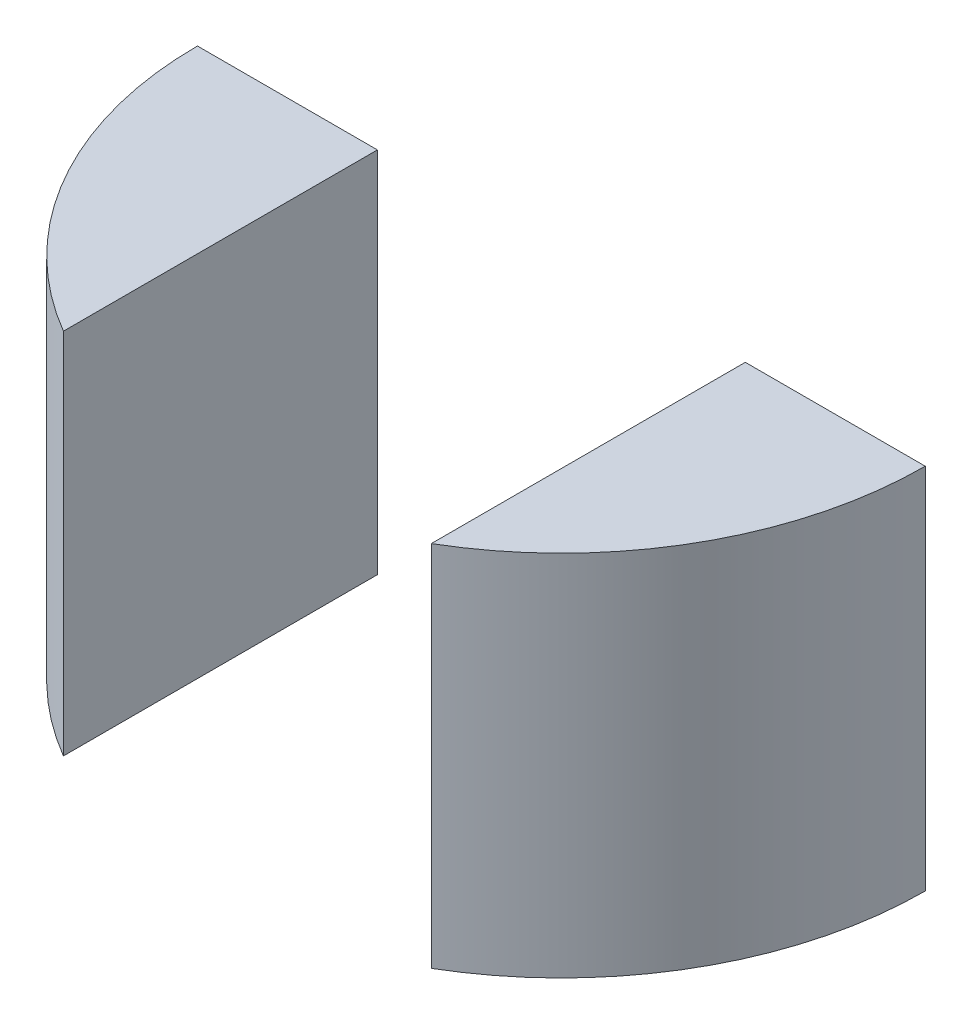
ISO-10303-21;
HEADER;
FILE_DESCRIPTION(('STEP AP214'),'2;1');
FILE_NAME('part.step','',(''),(''),'','','');
FILE_SCHEMA(('AUTOMOTIVE_DESIGN { 1 0 10303 214 1 1 1 1 }'));
ENDSEC;
DATA;
#1=APPLICATION_CONTEXT('core data for automotive mechanical design processes');
#2=APPLICATION_PROTOCOL_DEFINITION('international standard','automotive_design',2000,#1);
#3=PRODUCT_CONTEXT('',#1,'mechanical');
#4=PRODUCT('Part','Part','',(#3));
#5=PRODUCT_RELATED_PRODUCT_CATEGORY('part','',(#4));
#6=PRODUCT_DEFINITION_FORMATION('','',#4);
#7=PRODUCT_DEFINITION_CONTEXT('part definition',#1,'design');
#8=PRODUCT_DEFINITION('design','',#6,#7);
#9=PRODUCT_DEFINITION_SHAPE('','',#8);
#10=(LENGTH_UNIT() NAMED_UNIT(*) SI_UNIT(.MILLI.,.METRE.));
#11=(NAMED_UNIT(*) PLANE_ANGLE_UNIT() SI_UNIT($,.RADIAN.));
#12=(NAMED_UNIT(*) SI_UNIT($,.STERADIAN.) SOLID_ANGLE_UNIT());
#13=UNCERTAINTY_MEASURE_WITH_UNIT(LENGTH_MEASURE(1.E-05),#10,'distance_accuracy_value','');
#14=(GEOMETRIC_REPRESENTATION_CONTEXT(3) GLOBAL_UNCERTAINTY_ASSIGNED_CONTEXT((#13)) GLOBAL_UNIT_ASSIGNED_CONTEXT((#10,
#11,#12)) REPRESENTATION_CONTEXT('',''));
#15=CARTESIAN_POINT('',(0.,0.,0.));
#16=DIRECTION('',(0.,0.,1.));
#17=DIRECTION('',(1.,0.,0.));
#18=AXIS2_PLACEMENT_3D('',#15,#16,#17);
#19=CARTESIAN_POINT('',(0.,5.08,0.));
#20=DIRECTION('',(0.,-1.,0.));
#21=DIRECTION('',(0.,0.,-1.));
#22=AXIS2_PLACEMENT_3D('',#19,#20,#21);
#23=CYLINDRICAL_SURFACE('',#22,5.025);
#24=CARTESIAN_POINT('',(0.,5.08,0.));
#25=DIRECTION('',(0.,1.,0.));
#26=DIRECTION('',(0.,0.,1.));
#27=AXIS2_PLACEMENT_3D('',#24,#25,#26);
#28=CIRCLE('',#27,5.025);
#29=CARTESIAN_POINT('',(2.54,5.08,4.335784242787));
#30=VERTEX_POINT('',#29);
#31=CARTESIAN_POINT('',(5.025,5.08,0.));
#32=VERTEX_POINT('',#31);
#33=EDGE_CURVE('E88',#30,#32,#28,.T.);
#34=ORIENTED_EDGE('',*,*,#33,.F.);
#35=DIRECTION('',(0.,-1.,0.));
#36=VECTOR('',#35,1.);
#37=CARTESIAN_POINT('',(2.54,5.08,4.335784242787));
#38=LINE('',#37,#36);
#39=CARTESIAN_POINT('',(2.54,0.,4.335784242787));
#40=VERTEX_POINT('',#39);
#41=EDGE_CURVE('E63',#30,#40,#38,.T.);
#42=ORIENTED_EDGE('',*,*,#41,.T.);
#43=CARTESIAN_POINT('',(0.,0.,0.));
#44=DIRECTION('',(0.,1.,0.));
#45=DIRECTION('',(0.,0.,1.));
#46=AXIS2_PLACEMENT_3D('',#43,#44,#45);
#47=CIRCLE('',#46,5.025);
#48=CARTESIAN_POINT('',(5.025,0.,0.));
#49=VERTEX_POINT('',#48);
#50=EDGE_CURVE('E87',#40,#49,#47,.T.);
#51=ORIENTED_EDGE('',*,*,#50,.T.);
#52=DIRECTION('',(0.,1.,0.));
#53=VECTOR('',#52,1.);
#54=CARTESIAN_POINT('',(5.025,0.,0.));
#55=LINE('',#54,#53);
#56=EDGE_CURVE('E92',#49,#32,#55,.T.);
#57=ORIENTED_EDGE('',*,*,#56,.T.);
#58=EDGE_LOOP('',(#34,#42,#51,#57));
#59=FACE_BOUND('',#58,.T.);
#60=ADVANCED_FACE('F45',(#59),#23,.T.);
#61=CARTESIAN_POINT('',(0.,5.08,0.));
#62=DIRECTION('',(0.,1.,0.));
#63=DIRECTION('',(0.,0.,1.));
#64=AXIS2_PLACEMENT_3D('',#61,#62,#63);
#65=PLANE('',#64);
#66=DIRECTION('',(0.,0.,-1.));
#67=VECTOR('',#66,1.);
#68=CARTESIAN_POINT('',(2.54,5.08,10.));
#69=LINE('',#68,#67);
#70=CARTESIAN_POINT('',(2.54,5.08,0.));
#71=VERTEX_POINT('',#70);
#72=EDGE_CURVE('E54',#30,#71,#69,.T.);
#73=ORIENTED_EDGE('',*,*,#72,.F.);
#74=ORIENTED_EDGE('',*,*,#33,.T.);
#75=DIRECTION('',(1.,0.,0.));
#76=VECTOR('',#75,1.);
#77=CARTESIAN_POINT('',(5.025,5.08,0.));
#78=LINE('',#77,#76);
#79=EDGE_CURVE('E48',#71,#32,#78,.T.);
#80=ORIENTED_EDGE('',*,*,#79,.F.);
#81=EDGE_LOOP('',(#73,#74,#80));
#82=FACE_BOUND('',#81,.T.);
#83=ADVANCED_FACE('F101',(#82),#65,.T.);
#84=CARTESIAN_POINT('',(0.,0.,0.));
#85=DIRECTION('',(0.,1.,0.));
#86=DIRECTION('',(0.,0.,1.));
#87=AXIS2_PLACEMENT_3D('',#84,#85,#86);
#88=PLANE('',#87);
#89=ORIENTED_EDGE('',*,*,#50,.F.);
#90=DIRECTION('',(0.,0.,-1.));
#91=VECTOR('',#90,1.);
#92=CARTESIAN_POINT('',(2.54,0.,10.));
#93=LINE('',#92,#91);
#94=CARTESIAN_POINT('',(2.54,0.,0.));
#95=VERTEX_POINT('',#94);
#96=EDGE_CURVE('E76',#40,#95,#93,.T.);
#97=ORIENTED_EDGE('',*,*,#96,.T.);
#98=DIRECTION('',(1.,0.,0.));
#99=VECTOR('',#98,1.);
#100=CARTESIAN_POINT('',(0.,0.,0.));
#101=LINE('',#100,#99);
#102=EDGE_CURVE('E85',#95,#49,#101,.T.);
#103=ORIENTED_EDGE('',*,*,#102,.T.);
#104=EDGE_LOOP('',(#89,#97,#103));
#105=FACE_BOUND('',#104,.T.);
#106=ADVANCED_FACE('F84',(#105),#88,.F.);
#107=CARTESIAN_POINT('',(5.025,0.,0.));
#108=DIRECTION('',(0.,0.,1.));
#109=DIRECTION('',(1.,0.,0.));
#110=AXIS2_PLACEMENT_3D('',#107,#108,#109);
#111=PLANE('',#110);
#112=ORIENTED_EDGE('',*,*,#102,.F.);
#113=DIRECTION('',(0.,-1.,0.));
#114=VECTOR('',#113,1.);
#115=CARTESIAN_POINT('',(2.54,0.,0.));
#116=LINE('',#115,#114);
#117=EDGE_CURVE('E12',#71,#95,#116,.T.);
#118=ORIENTED_EDGE('',*,*,#117,.F.);
#119=ORIENTED_EDGE('',*,*,#79,.T.);
#120=ORIENTED_EDGE('',*,*,#56,.F.);
#121=EDGE_LOOP('',(#112,#118,#119,#120));
#122=FACE_BOUND('',#121,.T.);
#123=ADVANCED_FACE('F90',(#122),#111,.F.);
#124=CARTESIAN_POINT('',(2.54,0.,10.));
#125=DIRECTION('',(1.,0.,0.));
#126=DIRECTION('',(0.,0.,-1.));
#127=AXIS2_PLACEMENT_3D('',#124,#125,#126);
#128=PLANE('',#127);
#129=ORIENTED_EDGE('',*,*,#72,.T.);
#130=ORIENTED_EDGE('',*,*,#117,.T.);
#131=ORIENTED_EDGE('',*,*,#96,.F.);
#132=ORIENTED_EDGE('',*,*,#41,.F.);
#133=EDGE_LOOP('',(#129,#130,#131,#132));
#134=FACE_BOUND('',#133,.T.);
#135=ADVANCED_FACE('F75',(#134),#128,.F.);
#136=CLOSED_SHELL('',(#60,#83,#106,#123,#135));
#137=MANIFOLD_SOLID_BREP('B2',#136);
#138=CARTESIAN_POINT('',(5.025,0.,0.));
#139=DIRECTION('',(0.,0.,1.));
#140=DIRECTION('',(1.,0.,0.));
#141=AXIS2_PLACEMENT_3D('',#138,#139,#140);
#142=PLANE('',#141);
#143=DIRECTION('',(1.,0.,0.));
#144=VECTOR('',#143,1.);
#145=CARTESIAN_POINT('',(5.025,5.08,0.));
#146=LINE('',#145,#144);
#147=CARTESIAN_POINT('',(-5.025,5.08,0.));
#148=VERTEX_POINT('',#147);
#149=CARTESIAN_POINT('',(-2.54,5.08,0.));
#150=VERTEX_POINT('',#149);
#151=EDGE_CURVE('E184',#148,#150,#146,.T.);
#152=ORIENTED_EDGE('',*,*,#151,.T.);
#153=DIRECTION('',(0.,1.,0.));
#154=VECTOR('',#153,1.);
#155=CARTESIAN_POINT('',(-2.54,0.,0.));
#156=LINE('',#155,#154);
#157=CARTESIAN_POINT('',(-2.54,0.,0.));
#158=VERTEX_POINT('',#157);
#159=EDGE_CURVE('E173',#158,#150,#156,.T.);
#160=ORIENTED_EDGE('',*,*,#159,.F.);
#161=DIRECTION('',(1.,0.,0.));
#162=VECTOR('',#161,1.);
#163=CARTESIAN_POINT('',(0.,0.,0.));
#164=LINE('',#163,#162);
#165=CARTESIAN_POINT('',(-5.025,0.,0.));
#166=VERTEX_POINT('',#165);
#167=EDGE_CURVE('E43',#166,#158,#164,.T.);
#168=ORIENTED_EDGE('',*,*,#167,.F.);
#169=DIRECTION('',(0.,-1.,0.));
#170=VECTOR('',#169,1.);
#171=CARTESIAN_POINT('',(-5.025,5.08,0.));
#172=LINE('',#171,#170);
#173=EDGE_CURVE('E188',#148,#166,#172,.T.);
#174=ORIENTED_EDGE('',*,*,#173,.F.);
#175=EDGE_LOOP('',(#152,#160,#168,#174));
#176=FACE_BOUND('',#175,.T.);
#177=ADVANCED_FACE('F143',(#176),#142,.F.);
#178=CARTESIAN_POINT('',(0.,0.,0.));
#179=DIRECTION('',(0.,1.,0.));
#180=DIRECTION('',(0.,0.,1.));
#181=AXIS2_PLACEMENT_3D('',#178,#179,#180);
#182=PLANE('',#181);
#183=ORIENTED_EDGE('',*,*,#167,.T.);
#184=DIRECTION('',(0.,0.,-1.));
#185=VECTOR('',#184,1.);
#186=CARTESIAN_POINT('',(-2.54,0.,10.));
#187=LINE('',#186,#185);
#188=CARTESIAN_POINT('',(-2.54,0.,4.335784242787));
#189=VERTEX_POINT('',#188);
#190=EDGE_CURVE('E158',#189,#158,#187,.T.);
#191=ORIENTED_EDGE('',*,*,#190,.F.);
#192=CARTESIAN_POINT('',(0.,0.,0.));
#193=DIRECTION('',(0.,1.,0.));
#194=DIRECTION('',(0.,0.,1.));
#195=AXIS2_PLACEMENT_3D('',#192,#193,#194);
#196=CIRCLE('',#195,5.025);
#197=EDGE_CURVE('E190',#166,#189,#196,.T.);
#198=ORIENTED_EDGE('',*,*,#197,.F.);
#199=EDGE_LOOP('',(#183,#191,#198));
#200=FACE_BOUND('',#199,.T.);
#201=ADVANCED_FACE('F199',(#200),#182,.F.);
#202=CARTESIAN_POINT('',(0.,5.08,0.));
#203=DIRECTION('',(0.,1.,0.));
#204=DIRECTION('',(0.,0.,1.));
#205=AXIS2_PLACEMENT_3D('',#202,#203,#204);
#206=PLANE('',#205);
#207=DIRECTION('',(0.,0.,-1.));
#208=VECTOR('',#207,1.);
#209=CARTESIAN_POINT('',(-2.54,5.08,10.));
#210=LINE('',#209,#208);
#211=CARTESIAN_POINT('',(-2.54,5.08,4.335784242787));
#212=VERTEX_POINT('',#211);
#213=EDGE_CURVE('E176',#212,#150,#210,.T.);
#214=ORIENTED_EDGE('',*,*,#213,.T.);
#215=ORIENTED_EDGE('',*,*,#151,.F.);
#216=CARTESIAN_POINT('',(0.,5.08,0.));
#217=DIRECTION('',(0.,1.,0.));
#218=DIRECTION('',(0.,0.,1.));
#219=AXIS2_PLACEMENT_3D('',#216,#217,#218);
#220=CIRCLE('',#219,5.025);
#221=EDGE_CURVE('E151',#148,#212,#220,.T.);
#222=ORIENTED_EDGE('',*,*,#221,.T.);
#223=EDGE_LOOP('',(#214,#215,#222));
#224=FACE_BOUND('',#223,.T.);
#225=ADVANCED_FACE('F183',(#224),#206,.T.);
#226=CARTESIAN_POINT('',(0.,5.08,0.));
#227=DIRECTION('',(0.,-1.,0.));
#228=DIRECTION('',(0.,0.,-1.));
#229=AXIS2_PLACEMENT_3D('',#226,#227,#228);
#230=CYLINDRICAL_SURFACE('',#229,5.025);
#231=ORIENTED_EDGE('',*,*,#197,.T.);
#232=DIRECTION('',(0.,-1.,0.));
#233=VECTOR('',#232,1.);
#234=CARTESIAN_POINT('',(-2.54,5.08,4.335784242787));
#235=LINE('',#234,#233);
#236=EDGE_CURVE('E186',#189,#212,#235,.F.);
#237=ORIENTED_EDGE('',*,*,#236,.T.);
#238=ORIENTED_EDGE('',*,*,#221,.F.);
#239=ORIENTED_EDGE('',*,*,#173,.T.);
#240=EDGE_LOOP('',(#231,#237,#238,#239));
#241=FACE_BOUND('',#240,.T.);
#242=ADVANCED_FACE('F145',(#241),#230,.T.);
#243=CARTESIAN_POINT('',(-2.54,0.,10.));
#244=DIRECTION('',(-1.,0.,0.));
#245=DIRECTION('',(0.,-1.,0.));
#246=AXIS2_PLACEMENT_3D('',#243,#244,#245);
#247=PLANE('',#246);
#248=ORIENTED_EDGE('',*,*,#190,.T.);
#249=ORIENTED_EDGE('',*,*,#159,.T.);
#250=ORIENTED_EDGE('',*,*,#213,.F.);
#251=ORIENTED_EDGE('',*,*,#236,.F.);
#252=EDGE_LOOP('',(#248,#249,#250,#251));
#253=FACE_BOUND('',#252,.T.);
#254=ADVANCED_FACE('F175',(#253),#247,.F.);
#255=CLOSED_SHELL('',(#177,#201,#225,#242,#254));
#256=MANIFOLD_SOLID_BREP('B6',#255);
#257=ADVANCED_BREP_SHAPE_REPRESENTATION('',(#18,#137,#256),#14);
#258=SHAPE_DEFINITION_REPRESENTATION(#9,#257);
ENDSEC;
END-ISO-10303-21;
